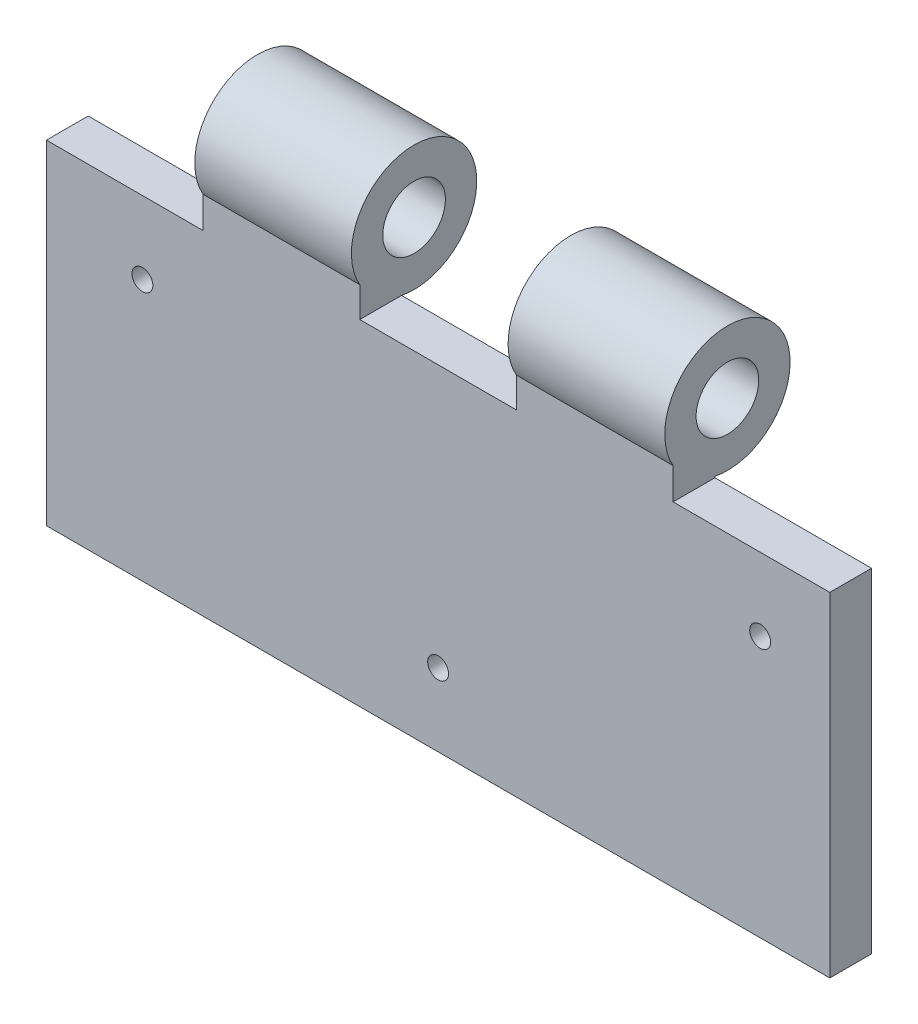
ISO-10303-21;
HEADER;
FILE_DESCRIPTION(('STEP AP214'),'2;1');
FILE_NAME('part.step','',(''),(''),'','','');
FILE_SCHEMA(('AUTOMOTIVE_DESIGN { 1 0 10303 214 1 1 1 1 }'));
ENDSEC;
DATA;
#1=APPLICATION_CONTEXT('core data for automotive mechanical design processes');
#2=APPLICATION_PROTOCOL_DEFINITION('international standard','automotive_design',2000,#1);
#3=PRODUCT_CONTEXT('',#1,'mechanical');
#4=PRODUCT('Part','Part','',(#3));
#5=PRODUCT_RELATED_PRODUCT_CATEGORY('part','',(#4));
#6=PRODUCT_DEFINITION_FORMATION('','',#4);
#7=PRODUCT_DEFINITION_CONTEXT('part definition',#1,'design');
#8=PRODUCT_DEFINITION('design','',#6,#7);
#9=PRODUCT_DEFINITION_SHAPE('','',#8);
#10=(LENGTH_UNIT() NAMED_UNIT(*) SI_UNIT(.MILLI.,.METRE.));
#11=(NAMED_UNIT(*) PLANE_ANGLE_UNIT() SI_UNIT($,.RADIAN.));
#12=(NAMED_UNIT(*) SI_UNIT($,.STERADIAN.) SOLID_ANGLE_UNIT());
#13=UNCERTAINTY_MEASURE_WITH_UNIT(LENGTH_MEASURE(1.E-05),#10,'distance_accuracy_value','');
#14=(GEOMETRIC_REPRESENTATION_CONTEXT(3) GLOBAL_UNCERTAINTY_ASSIGNED_CONTEXT((#13)) GLOBAL_UNIT_ASSIGNED_CONTEXT((#10,
#11,#12)) REPRESENTATION_CONTEXT('',''));
#15=CARTESIAN_POINT('',(0.,0.,0.));
#16=DIRECTION('',(0.,0.,1.));
#17=DIRECTION('',(1.,0.,0.));
#18=AXIS2_PLACEMENT_3D('',#15,#16,#17);
#19=CARTESIAN_POINT('',(0.,0.,4.));
#20=DIRECTION('',(0.,0.,1.));
#21=DIRECTION('',(1.,0.,0.));
#22=AXIS2_PLACEMENT_3D('',#19,#20,#21);
#23=PLANE('',#22);
#24=DIRECTION('',(0.,1.,0.));
#25=VECTOR('',#24,1.);
#26=CARTESIAN_POINT('',(15.,0.,4.));
#27=LINE('',#26,#25);
#28=CARTESIAN_POINT('',(15.,29.1962923306309,4.));
#29=VERTEX_POINT('',#28);
#30=CARTESIAN_POINT('',(15.,34.9678665123082,4.));
#31=VERTEX_POINT('',#30);
#32=EDGE_CURVE('E172',#29,#31,#27,.T.);
#33=ORIENTED_EDGE('',*,*,#32,.F.);
#34=DIRECTION('',(1.,0.,0.));
#35=VECTOR('',#34,1.);
#36=CARTESIAN_POINT('',(0.,29.1962923306309,4.));
#37=LINE('',#36,#35);
#38=CARTESIAN_POINT('',(-15.,29.1962923306309,4.));
#39=VERTEX_POINT('',#38);
#40=EDGE_CURVE('E145',#39,#29,#37,.T.);
#41=ORIENTED_EDGE('',*,*,#40,.F.);
#42=DIRECTION('',(0.,-1.,0.));
#43=VECTOR('',#42,1.);
#44=CARTESIAN_POINT('',(-15.,0.,4.));
#45=LINE('',#44,#43);
#46=CARTESIAN_POINT('',(-15.,34.9678665123082,4.));
#47=VERTEX_POINT('',#46);
#48=EDGE_CURVE('E564',#47,#39,#45,.T.);
#49=ORIENTED_EDGE('',*,*,#48,.F.);
#50=DIRECTION('',(1.,0.,0.));
#51=VECTOR('',#50,1.);
#52=CARTESIAN_POINT('',(-45.,34.9678665123082,4.));
#53=LINE('',#52,#51);
#54=CARTESIAN_POINT('',(-45.,34.9678665123082,4.));
#55=VERTEX_POINT('',#54);
#56=EDGE_CURVE('E528',#55,#47,#53,.T.);
#57=ORIENTED_EDGE('',*,*,#56,.F.);
#58=DIRECTION('',(0.,1.,0.));
#59=VECTOR('',#58,1.);
#60=CARTESIAN_POINT('',(-45.,0.,4.));
#61=LINE('',#60,#59);
#62=CARTESIAN_POINT('',(-45.,28.9537531894075,4.));
#63=VERTEX_POINT('',#62);
#64=EDGE_CURVE('E515',#63,#55,#61,.T.);
#65=ORIENTED_EDGE('',*,*,#64,.F.);
#66=DIRECTION('',(1.,0.,0.));
#67=VECTOR('',#66,1.);
#68=CARTESIAN_POINT('',(0.,28.9537531894075,4.));
#69=LINE('',#68,#67);
#70=CARTESIAN_POINT('',(-75.,28.9537531894075,4.));
#71=VERTEX_POINT('',#70);
#72=EDGE_CURVE('E508',#71,#63,#69,.T.);
#73=ORIENTED_EDGE('',*,*,#72,.F.);
#74=DIRECTION('',(0.,-1.,0.));
#75=VECTOR('',#74,1.);
#76=CARTESIAN_POINT('',(-75.,-35.,4.));
#77=LINE('',#76,#75);
#78=CARTESIAN_POINT('',(-75.,-35.,4.));
#79=VERTEX_POINT('',#78);
#80=EDGE_CURVE('E192',#71,#79,#77,.T.);
#81=ORIENTED_EDGE('',*,*,#80,.T.);
#82=DIRECTION('',(1.,0.,0.));
#83=VECTOR('',#82,1.);
#84=CARTESIAN_POINT('',(75.,-35.,4.));
#85=LINE('',#84,#83);
#86=CARTESIAN_POINT('',(75.,-35.,4.));
#87=VERTEX_POINT('',#86);
#88=EDGE_CURVE('E71',#79,#87,#85,.T.);
#89=ORIENTED_EDGE('',*,*,#88,.T.);
#90=DIRECTION('',(0.,1.,0.));
#91=VECTOR('',#90,1.);
#92=CARTESIAN_POINT('',(75.,-35.,4.));
#93=LINE('',#92,#91);
#94=CARTESIAN_POINT('',(75.,28.9537531894075,4.));
#95=VERTEX_POINT('',#94);
#96=EDGE_CURVE('E196',#87,#95,#93,.T.);
#97=ORIENTED_EDGE('',*,*,#96,.T.);
#98=DIRECTION('',(1.,0.,0.));
#99=VECTOR('',#98,1.);
#100=CARTESIAN_POINT('',(45.,28.9537531894075,4.));
#101=LINE('',#100,#99);
#102=CARTESIAN_POINT('',(45.,28.9537531894075,4.));
#103=VERTEX_POINT('',#102);
#104=EDGE_CURVE('E534',#103,#95,#101,.T.);
#105=ORIENTED_EDGE('',*,*,#104,.F.);
#106=DIRECTION('',(0.,-1.,0.));
#107=VECTOR('',#106,1.);
#108=CARTESIAN_POINT('',(45.,28.9537531894075,4.));
#109=LINE('',#108,#107);
#110=CARTESIAN_POINT('',(45.,34.9678665123082,4.));
#111=VERTEX_POINT('',#110);
#112=EDGE_CURVE('E514',#111,#103,#109,.T.);
#113=ORIENTED_EDGE('',*,*,#112,.F.);
#114=DIRECTION('',(1.,0.,0.));
#115=VECTOR('',#114,1.);
#116=CARTESIAN_POINT('',(15.,34.9678665123082,4.));
#117=LINE('',#116,#115);
#118=EDGE_CURVE('E174',#31,#111,#117,.T.);
#119=ORIENTED_EDGE('',*,*,#118,.F.);
#120=EDGE_LOOP('',(#33,#41,#49,#57,#65,#73,#81,#89,#97,#105,#113,#119));
#121=FACE_BOUND('',#120,.T.);
#122=CARTESIAN_POINT('',(-56.6305018989095,15.0158637322288,4.));
#123=DIRECTION('',(0.,0.,1.));
#124=DIRECTION('',(1.,0.,0.));
#125=AXIS2_PLACEMENT_3D('',#122,#123,#124);
#126=CIRCLE('',#125,2.);
#127=CARTESIAN_POINT('',(-54.6305018989095,15.0158637322288,4.));
#128=VERTEX_POINT('',#127);
#129=EDGE_CURVE('E184',#128,#128,#126,.T.);
#130=ORIENTED_EDGE('',*,*,#129,.F.);
#131=EDGE_LOOP('',(#130));
#132=FACE_BOUND('',#131,.T.);
#133=CARTESIAN_POINT('',(0.,-21.058085923715,4.));
#134=DIRECTION('',(0.,0.,1.));
#135=DIRECTION('',(1.,0.,0.));
#136=AXIS2_PLACEMENT_3D('',#133,#134,#135);
#137=CIRCLE('',#136,2.);
#138=CARTESIAN_POINT('',(2.,-21.058085923715,4.));
#139=VERTEX_POINT('',#138);
#140=EDGE_CURVE('E187',#139,#139,#137,.T.);
#141=ORIENTED_EDGE('',*,*,#140,.F.);
#142=EDGE_LOOP('',(#141));
#143=FACE_BOUND('',#142,.T.);
#144=CARTESIAN_POINT('',(61.6696567288971,15.0158637322288,4.));
#145=DIRECTION('',(0.,0.,1.));
#146=DIRECTION('',(1.,0.,0.));
#147=AXIS2_PLACEMENT_3D('',#144,#145,#146);
#148=CIRCLE('',#147,2.);
#149=CARTESIAN_POINT('',(63.6696567288971,15.0158637322288,4.));
#150=VERTEX_POINT('',#149);
#151=EDGE_CURVE('E176',#150,#150,#148,.T.);
#152=ORIENTED_EDGE('',*,*,#151,.F.);
#153=EDGE_LOOP('',(#152));
#154=FACE_BOUND('',#153,.T.);
#155=ADVANCED_FACE('F53',(#121,#132,#143,#154),#23,.T.);
#156=CARTESIAN_POINT('',(0.,0.,-4.));
#157=DIRECTION('',(0.,0.,1.));
#158=DIRECTION('',(1.,0.,0.));
#159=AXIS2_PLACEMENT_3D('',#156,#157,#158);
#160=PLANE('',#159);
#161=CARTESIAN_POINT('',(-56.6305018989095,15.0158637322288,-4.));
#162=DIRECTION('',(0.,0.,1.));
#163=DIRECTION('',(1.,0.,0.));
#164=AXIS2_PLACEMENT_3D('',#161,#162,#163);
#165=CIRCLE('',#164,5.99999999999998);
#166=CARTESIAN_POINT('',(-50.6305018989095,15.0158637322288,-4.));
#167=VERTEX_POINT('',#166);
#168=EDGE_CURVE('E215',#167,#167,#165,.T.);
#169=ORIENTED_EDGE('',*,*,#168,.T.);
#170=EDGE_LOOP('',(#169));
#171=FACE_BOUND('',#170,.T.);
#172=CARTESIAN_POINT('',(0.,-21.058085923715,-4.));
#173=DIRECTION('',(0.,0.,1.));
#174=DIRECTION('',(1.,0.,0.));
#175=AXIS2_PLACEMENT_3D('',#172,#173,#174);
#176=CIRCLE('',#175,5.99999999999998);
#177=CARTESIAN_POINT('',(5.99999999999998,-21.058085923715,-4.));
#178=VERTEX_POINT('',#177);
#179=EDGE_CURVE('E212',#178,#178,#176,.T.);
#180=ORIENTED_EDGE('',*,*,#179,.T.);
#181=EDGE_LOOP('',(#180));
#182=FACE_BOUND('',#181,.T.);
#183=CARTESIAN_POINT('',(61.6696567288971,15.0158637322288,-4.));
#184=DIRECTION('',(0.,0.,1.));
#185=DIRECTION('',(1.,0.,0.));
#186=AXIS2_PLACEMENT_3D('',#183,#184,#185);
#187=CIRCLE('',#186,5.99999999999994);
#188=CARTESIAN_POINT('',(67.6696567288971,15.0158637322288,-4.));
#189=VERTEX_POINT('',#188);
#190=EDGE_CURVE('E209',#189,#189,#187,.T.);
#191=ORIENTED_EDGE('',*,*,#190,.T.);
#192=EDGE_LOOP('',(#191));
#193=FACE_BOUND('',#192,.T.);
#194=DIRECTION('',(1.,0.,0.));
#195=VECTOR('',#194,1.);
#196=CARTESIAN_POINT('',(-45.,29.1962923306309,-4.));
#197=LINE('',#196,#195);
#198=CARTESIAN_POINT('',(-45.,29.1962923306309,-4.));
#199=VERTEX_POINT('',#198);
#200=CARTESIAN_POINT('',(-15.,29.1962923306309,-4.));
#201=VERTEX_POINT('',#200);
#202=EDGE_CURVE('E160',#199,#201,#197,.T.);
#203=ORIENTED_EDGE('',*,*,#202,.T.);
#204=DIRECTION('',(-1.,0.,0.));
#205=VECTOR('',#204,1.);
#206=CARTESIAN_POINT('',(15.,29.1962923306309,-4.));
#207=LINE('',#206,#205);
#208=CARTESIAN_POINT('',(15.,29.1962923306309,-4.));
#209=VERTEX_POINT('',#208);
#210=EDGE_CURVE('E90',#209,#201,#207,.T.);
#211=ORIENTED_EDGE('',*,*,#210,.F.);
#212=DIRECTION('',(1.,0.,0.));
#213=VECTOR('',#212,1.);
#214=CARTESIAN_POINT('',(15.,29.1962923306309,-4.));
#215=LINE('',#214,#213);
#216=CARTESIAN_POINT('',(45.,29.1962923306309,-4.));
#217=VERTEX_POINT('',#216);
#218=EDGE_CURVE('E158',#209,#217,#215,.T.);
#219=ORIENTED_EDGE('',*,*,#218,.T.);
#220=DIRECTION('',(0.,-1.,0.));
#221=VECTOR('',#220,1.);
#222=CARTESIAN_POINT('',(45.,0.,-4.));
#223=LINE('',#222,#221);
#224=CARTESIAN_POINT('',(45.,28.9537531894075,-4.));
#225=VERTEX_POINT('',#224);
#226=EDGE_CURVE('E540',#217,#225,#223,.T.);
#227=ORIENTED_EDGE('',*,*,#226,.T.);
#228=DIRECTION('',(1.,0.,0.));
#229=VECTOR('',#228,1.);
#230=CARTESIAN_POINT('',(0.,28.9537531894075,-4.));
#231=LINE('',#230,#229);
#232=CARTESIAN_POINT('',(75.,28.9537531894075,-4.));
#233=VERTEX_POINT('',#232);
#234=EDGE_CURVE('E543',#225,#233,#231,.T.);
#235=ORIENTED_EDGE('',*,*,#234,.T.);
#236=DIRECTION('',(0.,1.,0.));
#237=VECTOR('',#236,1.);
#238=CARTESIAN_POINT('',(75.,-35.,-4.));
#239=LINE('',#238,#237);
#240=CARTESIAN_POINT('',(75.,-35.,-4.));
#241=VERTEX_POINT('',#240);
#242=EDGE_CURVE('E194',#241,#233,#239,.T.);
#243=ORIENTED_EDGE('',*,*,#242,.F.);
#244=DIRECTION('',(1.,0.,0.));
#245=VECTOR('',#244,1.);
#246=CARTESIAN_POINT('',(75.,-35.,-4.));
#247=LINE('',#246,#245);
#248=CARTESIAN_POINT('',(-75.,-35.,-4.));
#249=VERTEX_POINT('',#248);
#250=EDGE_CURVE('E200',#249,#241,#247,.T.);
#251=ORIENTED_EDGE('',*,*,#250,.F.);
#252=DIRECTION('',(0.,-1.,0.));
#253=VECTOR('',#252,1.);
#254=CARTESIAN_POINT('',(-75.,-35.,-4.));
#255=LINE('',#254,#253);
#256=CARTESIAN_POINT('',(-75.,28.9537531894075,-4.));
#257=VERTEX_POINT('',#256);
#258=EDGE_CURVE('E81',#257,#249,#255,.T.);
#259=ORIENTED_EDGE('',*,*,#258,.F.);
#260=DIRECTION('',(-1.,0.,0.));
#261=VECTOR('',#260,1.);
#262=CARTESIAN_POINT('',(-75.,28.9537531894075,-4.));
#263=LINE('',#262,#261);
#264=CARTESIAN_POINT('',(-45.,28.9537531894075,-4.));
#265=VERTEX_POINT('',#264);
#266=EDGE_CURVE('E523',#265,#257,#263,.T.);
#267=ORIENTED_EDGE('',*,*,#266,.F.);
#268=DIRECTION('',(0.,-1.,0.));
#269=VECTOR('',#268,1.);
#270=CARTESIAN_POINT('',(-45.,35.,-4.));
#271=LINE('',#270,#269);
#272=EDGE_CURVE('E521',#199,#265,#271,.T.);
#273=ORIENTED_EDGE('',*,*,#272,.F.);
#274=EDGE_LOOP('',(#203,#211,#219,#227,#235,#243,#251,#259,#267,#273));
#275=FACE_BOUND('',#274,.T.);
#276=ADVANCED_FACE('F156',(#171,#182,#193,#275),#160,.F.);
#277=CARTESIAN_POINT('',(-75.,-35.,4.));
#278=DIRECTION('',(1.,0.,0.));
#279=DIRECTION('',(0.,0.,-1.));
#280=AXIS2_PLACEMENT_3D('',#277,#278,#279);
#281=PLANE('',#280);
#282=ORIENTED_EDGE('',*,*,#80,.F.);
#283=DIRECTION('',(0.,0.,-1.));
#284=VECTOR('',#283,1.);
#285=CARTESIAN_POINT('',(-75.,28.9537531894075,4.));
#286=LINE('',#285,#284);
#287=EDGE_CURVE('E12',#71,#257,#286,.T.);
#288=ORIENTED_EDGE('',*,*,#287,.T.);
#289=ORIENTED_EDGE('',*,*,#258,.T.);
#290=DIRECTION('',(0.,0.,-1.));
#291=VECTOR('',#290,1.);
#292=CARTESIAN_POINT('',(-75.,-35.,4.));
#293=LINE('',#292,#291);
#294=EDGE_CURVE('E168',#79,#249,#293,.T.);
#295=ORIENTED_EDGE('',*,*,#294,.F.);
#296=EDGE_LOOP('',(#282,#288,#289,#295));
#297=FACE_BOUND('',#296,.T.);
#298=ADVANCED_FACE('F236',(#297),#281,.F.);
#299=CARTESIAN_POINT('',(75.,-35.,4.));
#300=DIRECTION('',(0.,1.,0.));
#301=DIRECTION('',(-1.,0.,0.));
#302=AXIS2_PLACEMENT_3D('',#299,#300,#301);
#303=PLANE('',#302);
#304=ORIENTED_EDGE('',*,*,#250,.T.);
#305=DIRECTION('',(0.,0.,-1.));
#306=VECTOR('',#305,1.);
#307=CARTESIAN_POINT('',(75.,-35.,4.));
#308=LINE('',#307,#306);
#309=EDGE_CURVE('E198',#87,#241,#308,.T.);
#310=ORIENTED_EDGE('',*,*,#309,.F.);
#311=ORIENTED_EDGE('',*,*,#88,.F.);
#312=ORIENTED_EDGE('',*,*,#294,.T.);
#313=EDGE_LOOP('',(#304,#310,#311,#312));
#314=FACE_BOUND('',#313,.T.);
#315=ADVANCED_FACE('F243',(#314),#303,.F.);
#316=CARTESIAN_POINT('',(75.,-35.,4.));
#317=DIRECTION('',(-1.,0.,0.));
#318=DIRECTION('',(0.,0.,1.));
#319=AXIS2_PLACEMENT_3D('',#316,#317,#318);
#320=PLANE('',#319);
#321=ORIENTED_EDGE('',*,*,#242,.T.);
#322=DIRECTION('',(0.,0.,1.));
#323=VECTOR('',#322,1.);
#324=CARTESIAN_POINT('',(75.,28.9537531894075,-6.));
#325=LINE('',#324,#323);
#326=EDGE_CURVE('E537',#233,#95,#325,.T.);
#327=ORIENTED_EDGE('',*,*,#326,.T.);
#328=ORIENTED_EDGE('',*,*,#96,.F.);
#329=ORIENTED_EDGE('',*,*,#309,.T.);
#330=EDGE_LOOP('',(#321,#327,#328,#329));
#331=FACE_BOUND('',#330,.T.);
#332=ADVANCED_FACE('F249',(#331),#320,.F.);
#333=CARTESIAN_POINT('',(61.6696567288971,15.0158637322288,-26.));
#334=DIRECTION('',(0.,0.,1.));
#335=DIRECTION('',(1.,0.,0.));
#336=AXIS2_PLACEMENT_3D('',#333,#334,#335);
#337=CYLINDRICAL_SURFACE('',#336,2.);
#338=CARTESIAN_POINT('',(61.6696567288971,15.0158637322288,0.));
#339=DIRECTION('',(0.,0.,1.));
#340=DIRECTION('',(1.,0.,0.));
#341=AXIS2_PLACEMENT_3D('',#338,#339,#340);
#342=CIRCLE('',#341,2.);
#343=CARTESIAN_POINT('',(63.6696567288971,15.0158637322288,0.));
#344=VERTEX_POINT('',#343);
#345=EDGE_CURVE('E63',#344,#344,#342,.F.);
#346=ORIENTED_EDGE('',*,*,#345,.T.);
#347=EDGE_LOOP('',(#346));
#348=FACE_BOUND('',#347,.T.);
#349=ORIENTED_EDGE('',*,*,#151,.T.);
#350=EDGE_LOOP('',(#349));
#351=FACE_BOUND('',#350,.T.);
#352=ADVANCED_FACE('F226',(#348,#351),#337,.F.);
#353=CARTESIAN_POINT('',(0.,-21.058085923715,-26.));
#354=DIRECTION('',(0.,0.,1.));
#355=DIRECTION('',(1.,0.,0.));
#356=AXIS2_PLACEMENT_3D('',#353,#354,#355);
#357=CYLINDRICAL_SURFACE('',#356,2.);
#358=CARTESIAN_POINT('',(0.,-21.058085923715,0.));
#359=DIRECTION('',(0.,0.,1.));
#360=DIRECTION('',(1.,0.,0.));
#361=AXIS2_PLACEMENT_3D('',#358,#359,#360);
#362=CIRCLE('',#361,2.);
#363=CARTESIAN_POINT('',(2.,-21.058085923715,0.));
#364=VERTEX_POINT('',#363);
#365=EDGE_CURVE('E221',#364,#364,#362,.F.);
#366=ORIENTED_EDGE('',*,*,#365,.T.);
#367=EDGE_LOOP('',(#366));
#368=FACE_BOUND('',#367,.T.);
#369=ORIENTED_EDGE('',*,*,#140,.T.);
#370=EDGE_LOOP('',(#369));
#371=FACE_BOUND('',#370,.T.);
#372=ADVANCED_FACE('F274',(#368,#371),#357,.F.);
#373=CARTESIAN_POINT('',(-56.6305018989095,15.0158637322288,-26.));
#374=DIRECTION('',(0.,0.,1.));
#375=DIRECTION('',(1.,0.,0.));
#376=AXIS2_PLACEMENT_3D('',#373,#374,#375);
#377=CYLINDRICAL_SURFACE('',#376,2.);
#378=CARTESIAN_POINT('',(-56.6305018989095,15.0158637322288,0.));
#379=DIRECTION('',(0.,0.,1.));
#380=DIRECTION('',(1.,0.,0.));
#381=AXIS2_PLACEMENT_3D('',#378,#379,#380);
#382=CIRCLE('',#381,2.);
#383=CARTESIAN_POINT('',(-54.6305018989095,15.0158637322288,0.));
#384=VERTEX_POINT('',#383);
#385=EDGE_CURVE('E218',#384,#384,#382,.F.);
#386=ORIENTED_EDGE('',*,*,#385,.T.);
#387=EDGE_LOOP('',(#386));
#388=FACE_BOUND('',#387,.T.);
#389=ORIENTED_EDGE('',*,*,#129,.T.);
#390=EDGE_LOOP('',(#389));
#391=FACE_BOUND('',#390,.T.);
#392=ADVANCED_FACE('F277',(#388,#391),#377,.F.);
#393=CARTESIAN_POINT('',(15.,40.9537531894075,-6.40044040841181));
#394=DIRECTION('',(1.,0.,0.));
#395=DIRECTION('',(0.,0.,-1.));
#396=AXIS2_PLACEMENT_3D('',#393,#394,#395);
#397=CYLINDRICAL_SURFACE('',#396,12.);
#398=CARTESIAN_POINT('',(15.,40.9537531894075,-6.40044040841181));
#399=DIRECTION('',(1.,0.,0.));
#400=DIRECTION('',(0.,0.,-1.));
#401=AXIS2_PLACEMENT_3D('',#398,#399,#400);
#402=CIRCLE('',#401,12.);
#403=EDGE_CURVE('E166',#209,#31,#402,.T.);
#404=ORIENTED_EDGE('',*,*,#403,.T.);
#405=ORIENTED_EDGE('',*,*,#118,.T.);
#406=CARTESIAN_POINT('',(45.,40.9537531894075,-6.40044040841181));
#407=DIRECTION('',(1.,0.,0.));
#408=DIRECTION('',(0.,0.,-1.));
#409=AXIS2_PLACEMENT_3D('',#406,#407,#408);
#410=CIRCLE('',#409,12.);
#411=EDGE_CURVE('E167',#217,#111,#410,.T.);
#412=ORIENTED_EDGE('',*,*,#411,.F.);
#413=ORIENTED_EDGE('',*,*,#218,.F.);
#414=EDGE_LOOP('',(#404,#405,#412,#413));
#415=FACE_BOUND('',#414,.T.);
#416=ADVANCED_FACE('F164',(#415),#397,.T.);
#417=CARTESIAN_POINT('',(15.,40.9537531894075,-6.40044040841181));
#418=DIRECTION('',(1.,0.,0.));
#419=DIRECTION('',(0.,0.,-1.));
#420=AXIS2_PLACEMENT_3D('',#417,#418,#419);
#421=PLANE('',#420);
#422=ORIENTED_EDGE('',*,*,#32,.T.);
#423=ORIENTED_EDGE('',*,*,#403,.F.);
#424=DIRECTION('',(0.,0.,-1.));
#425=VECTOR('',#424,1.);
#426=CARTESIAN_POINT('',(15.,29.1962923306309,6.));
#427=LINE('',#426,#425);
#428=EDGE_CURVE('E142',#29,#209,#427,.T.);
#429=ORIENTED_EDGE('',*,*,#428,.F.);
#430=EDGE_LOOP('',(#422,#423,#429));
#431=FACE_BOUND('',#430,.T.);
#432=CARTESIAN_POINT('',(15.,40.9537531894075,-6.40044040841181));
#433=DIRECTION('',(1.,0.,0.));
#434=DIRECTION('',(0.,0.,-1.));
#435=AXIS2_PLACEMENT_3D('',#432,#433,#434);
#436=CIRCLE('',#435,6.);
#437=CARTESIAN_POINT('',(15.,40.9537531894075,-12.4004404084118));
#438=VERTEX_POINT('',#437);
#439=EDGE_CURVE('E178',#438,#438,#436,.T.);
#440=ORIENTED_EDGE('',*,*,#439,.T.);
#441=EDGE_LOOP('',(#440));
#442=FACE_BOUND('',#441,.T.);
#443=ADVANCED_FACE('F170',(#431,#442),#421,.F.);
#444=CARTESIAN_POINT('',(45.,40.9537531894075,-6.40044040841181));
#445=DIRECTION('',(1.,0.,0.));
#446=DIRECTION('',(0.,0.,-1.));
#447=AXIS2_PLACEMENT_3D('',#444,#445,#446);
#448=PLANE('',#447);
#449=ORIENTED_EDGE('',*,*,#226,.F.);
#450=ORIENTED_EDGE('',*,*,#411,.T.);
#451=ORIENTED_EDGE('',*,*,#112,.T.);
#452=DIRECTION('',(0.,0.,1.));
#453=VECTOR('',#452,1.);
#454=CARTESIAN_POINT('',(45.,28.9537531894075,-6.));
#455=LINE('',#454,#453);
#456=EDGE_CURVE('E536',#225,#103,#455,.T.);
#457=ORIENTED_EDGE('',*,*,#456,.F.);
#458=EDGE_LOOP('',(#449,#450,#451,#457));
#459=FACE_BOUND('',#458,.T.);
#460=CARTESIAN_POINT('',(45.,40.9537531894075,-6.40044040841181));
#461=DIRECTION('',(1.,0.,0.));
#462=DIRECTION('',(0.,0.,-1.));
#463=AXIS2_PLACEMENT_3D('',#460,#461,#462);
#464=CIRCLE('',#463,6.);
#465=CARTESIAN_POINT('',(45.,40.9537531894075,-12.4004404084118));
#466=VERTEX_POINT('',#465);
#467=EDGE_CURVE('E181',#466,#466,#464,.T.);
#468=ORIENTED_EDGE('',*,*,#467,.F.);
#469=EDGE_LOOP('',(#468));
#470=FACE_BOUND('',#469,.T.);
#471=ADVANCED_FACE('F292',(#459,#470),#448,.T.);
#472=CARTESIAN_POINT('',(15.,40.9537531894075,-6.40044040841181));
#473=DIRECTION('',(1.,0.,0.));
#474=DIRECTION('',(0.,0.,-1.));
#475=AXIS2_PLACEMENT_3D('',#472,#473,#474);
#476=CYLINDRICAL_SURFACE('',#475,6.);
#477=ORIENTED_EDGE('',*,*,#439,.F.);
#478=EDGE_LOOP('',(#477));
#479=FACE_BOUND('',#478,.T.);
#480=ORIENTED_EDGE('',*,*,#467,.T.);
#481=EDGE_LOOP('',(#480));
#482=FACE_BOUND('',#481,.T.);
#483=ADVANCED_FACE('F295',(#479,#482),#476,.F.);
#484=CARTESIAN_POINT('',(-45.,40.9537531894075,-6.40044040841181));
#485=DIRECTION('',(1.,0.,0.));
#486=DIRECTION('',(0.,0.,-1.));
#487=AXIS2_PLACEMENT_3D('',#484,#485,#486);
#488=CYLINDRICAL_SURFACE('',#487,12.);
#489=CARTESIAN_POINT('',(-45.,40.9537531894075,-6.40044040841181));
#490=DIRECTION('',(1.,0.,0.));
#491=DIRECTION('',(0.,0.,-1.));
#492=AXIS2_PLACEMENT_3D('',#489,#490,#491);
#493=CIRCLE('',#492,12.);
#494=EDGE_CURVE('E553',#199,#55,#493,.T.);
#495=ORIENTED_EDGE('',*,*,#494,.T.);
#496=ORIENTED_EDGE('',*,*,#56,.T.);
#497=CARTESIAN_POINT('',(-15.,40.9537531894075,-6.40044040841181));
#498=DIRECTION('',(1.,0.,0.));
#499=DIRECTION('',(0.,0.,-1.));
#500=AXIS2_PLACEMENT_3D('',#497,#498,#499);
#501=CIRCLE('',#500,12.);
#502=EDGE_CURVE('E550',#201,#47,#501,.T.);
#503=ORIENTED_EDGE('',*,*,#502,.F.);
#504=ORIENTED_EDGE('',*,*,#202,.F.);
#505=EDGE_LOOP('',(#495,#496,#503,#504));
#506=FACE_BOUND('',#505,.T.);
#507=ADVANCED_FACE('F301',(#506),#488,.T.);
#508=CARTESIAN_POINT('',(-45.,40.9537531894075,-6.40044040841181));
#509=DIRECTION('',(1.,0.,0.));
#510=DIRECTION('',(0.,0.,-1.));
#511=AXIS2_PLACEMENT_3D('',#508,#509,#510);
#512=PLANE('',#511);
#513=ORIENTED_EDGE('',*,*,#64,.T.);
#514=ORIENTED_EDGE('',*,*,#494,.F.);
#515=ORIENTED_EDGE('',*,*,#272,.T.);
#516=DIRECTION('',(0.,0.,-1.));
#517=VECTOR('',#516,1.);
#518=CARTESIAN_POINT('',(-45.,28.9537531894075,6.));
#519=LINE('',#518,#517);
#520=EDGE_CURVE('E510',#63,#265,#519,.T.);
#521=ORIENTED_EDGE('',*,*,#520,.F.);
#522=EDGE_LOOP('',(#513,#514,#515,#521));
#523=FACE_BOUND('',#522,.T.);
#524=CARTESIAN_POINT('',(-45.,40.9537531894075,-6.40044040841181));
#525=DIRECTION('',(1.,0.,0.));
#526=DIRECTION('',(0.,0.,-1.));
#527=AXIS2_PLACEMENT_3D('',#524,#525,#526);
#528=CIRCLE('',#527,6.);
#529=CARTESIAN_POINT('',(-45.,40.9537531894075,-12.4004404084118));
#530=VERTEX_POINT('',#529);
#531=EDGE_CURVE('E547',#530,#530,#528,.T.);
#532=ORIENTED_EDGE('',*,*,#531,.T.);
#533=EDGE_LOOP('',(#532));
#534=FACE_BOUND('',#533,.T.);
#535=ADVANCED_FACE('F305',(#523,#534),#512,.F.);
#536=CARTESIAN_POINT('',(-15.,40.9537531894075,-6.40044040841181));
#537=DIRECTION('',(1.,0.,0.));
#538=DIRECTION('',(0.,0.,-1.));
#539=AXIS2_PLACEMENT_3D('',#536,#537,#538);
#540=PLANE('',#539);
#541=ORIENTED_EDGE('',*,*,#502,.T.);
#542=ORIENTED_EDGE('',*,*,#48,.T.);
#543=DIRECTION('',(0.,0.,-1.));
#544=VECTOR('',#543,1.);
#545=CARTESIAN_POINT('',(-15.,29.1962923306309,6.));
#546=LINE('',#545,#544);
#547=EDGE_CURVE('E150',#39,#201,#546,.T.);
#548=ORIENTED_EDGE('',*,*,#547,.T.);
#549=EDGE_LOOP('',(#541,#542,#548));
#550=FACE_BOUND('',#549,.T.);
#551=CARTESIAN_POINT('',(-15.,40.9537531894075,-6.40044040841181));
#552=DIRECTION('',(1.,0.,0.));
#553=DIRECTION('',(0.,0.,-1.));
#554=AXIS2_PLACEMENT_3D('',#551,#552,#553);
#555=CIRCLE('',#554,6.);
#556=CARTESIAN_POINT('',(-15.,40.9537531894075,-12.4004404084118));
#557=VERTEX_POINT('',#556);
#558=EDGE_CURVE('E546',#557,#557,#555,.T.);
#559=ORIENTED_EDGE('',*,*,#558,.F.);
#560=EDGE_LOOP('',(#559));
#561=FACE_BOUND('',#560,.T.);
#562=ADVANCED_FACE('F307',(#550,#561),#540,.T.);
#563=CARTESIAN_POINT('',(-45.,40.9537531894075,-6.40044040841181));
#564=DIRECTION('',(1.,0.,0.));
#565=DIRECTION('',(0.,0.,-1.));
#566=AXIS2_PLACEMENT_3D('',#563,#564,#565);
#567=CYLINDRICAL_SURFACE('',#566,6.);
#568=ORIENTED_EDGE('',*,*,#531,.F.);
#569=EDGE_LOOP('',(#568));
#570=FACE_BOUND('',#569,.T.);
#571=ORIENTED_EDGE('',*,*,#558,.T.);
#572=EDGE_LOOP('',(#571));
#573=FACE_BOUND('',#572,.T.);
#574=ADVANCED_FACE('F262',(#570,#573),#567,.F.);
#575=CARTESIAN_POINT('',(-56.6305018989095,15.0158637322288,-4.));
#576=DIRECTION('',(0.,0.,-1.));
#577=DIRECTION('',(-1.,0.,0.));
#578=AXIS2_PLACEMENT_3D('',#575,#576,#577);
#579=CONICAL_SURFACE('',#578,5.99999999999998,0.785398163397446);
#580=ORIENTED_EDGE('',*,*,#385,.F.);
#581=EDGE_LOOP('',(#580));
#582=FACE_BOUND('',#581,.T.);
#583=ORIENTED_EDGE('',*,*,#168,.F.);
#584=EDGE_LOOP('',(#583));
#585=FACE_BOUND('',#584,.T.);
#586=ADVANCED_FACE('F257',(#582,#585),#579,.F.);
#587=CARTESIAN_POINT('',(0.,-21.058085923715,-4.));
#588=DIRECTION('',(0.,0.,-1.));
#589=DIRECTION('',(-1.,0.,0.));
#590=AXIS2_PLACEMENT_3D('',#587,#588,#589);
#591=CONICAL_SURFACE('',#590,5.99999999999998,0.785398163397446);
#592=ORIENTED_EDGE('',*,*,#365,.F.);
#593=EDGE_LOOP('',(#592));
#594=FACE_BOUND('',#593,.T.);
#595=ORIENTED_EDGE('',*,*,#179,.F.);
#596=EDGE_LOOP('',(#595));
#597=FACE_BOUND('',#596,.T.);
#598=ADVANCED_FACE('F232',(#594,#597),#591,.F.);
#599=CARTESIAN_POINT('',(61.6696567288971,15.0158637322288,-4.));
#600=DIRECTION('',(0.,0.,-1.));
#601=DIRECTION('',(-1.,0.,0.));
#602=AXIS2_PLACEMENT_3D('',#599,#600,#601);
#603=CONICAL_SURFACE('',#602,5.99999999999994,0.785398163397446);
#604=ORIENTED_EDGE('',*,*,#345,.F.);
#605=EDGE_LOOP('',(#604));
#606=FACE_BOUND('',#605,.T.);
#607=ORIENTED_EDGE('',*,*,#190,.F.);
#608=EDGE_LOOP('',(#607));
#609=FACE_BOUND('',#608,.T.);
#610=ADVANCED_FACE('F56',(#606,#609),#603,.F.);
#611=CARTESIAN_POINT('',(45.,28.9537531894075,-6.));
#612=DIRECTION('',(0.,-1.,0.));
#613=DIRECTION('',(0.,0.,-1.));
#614=AXIS2_PLACEMENT_3D('',#611,#612,#613);
#615=PLANE('',#614);
#616=ORIENTED_EDGE('',*,*,#456,.T.);
#617=ORIENTED_EDGE('',*,*,#104,.T.);
#618=ORIENTED_EDGE('',*,*,#326,.F.);
#619=ORIENTED_EDGE('',*,*,#234,.F.);
#620=EDGE_LOOP('',(#616,#617,#618,#619));
#621=FACE_BOUND('',#620,.T.);
#622=ADVANCED_FACE('F231',(#621),#615,.F.);
#623=CARTESIAN_POINT('',(-75.,28.9537531894075,6.));
#624=DIRECTION('',(0.,-1.,0.));
#625=DIRECTION('',(0.,0.,-1.));
#626=AXIS2_PLACEMENT_3D('',#623,#624,#625);
#627=PLANE('',#626);
#628=ORIENTED_EDGE('',*,*,#72,.T.);
#629=ORIENTED_EDGE('',*,*,#520,.T.);
#630=ORIENTED_EDGE('',*,*,#266,.T.);
#631=ORIENTED_EDGE('',*,*,#287,.F.);
#632=EDGE_LOOP('',(#628,#629,#630,#631));
#633=FACE_BOUND('',#632,.T.);
#634=ADVANCED_FACE('F319',(#633),#627,.F.);
#635=CARTESIAN_POINT('',(15.,29.1962923306309,6.));
#636=DIRECTION('',(0.,-1.,0.));
#637=DIRECTION('',(0.,0.,-1.));
#638=AXIS2_PLACEMENT_3D('',#635,#636,#637);
#639=PLANE('',#638);
#640=ORIENTED_EDGE('',*,*,#40,.T.);
#641=ORIENTED_EDGE('',*,*,#428,.T.);
#642=ORIENTED_EDGE('',*,*,#210,.T.);
#643=ORIENTED_EDGE('',*,*,#547,.F.);
#644=EDGE_LOOP('',(#640,#641,#642,#643));
#645=FACE_BOUND('',#644,.T.);
#646=ADVANCED_FACE('F143',(#645),#639,.F.);
#647=CLOSED_SHELL('',(#155,#276,#298,#315,#332,#352,#372,#392,#416,#443,#471,#483,#507,#535,
#562,#574,#586,#598,#610,#622,#634,#646));
#648=MANIFOLD_SOLID_BREP('B2',#647);
#649=ADVANCED_BREP_SHAPE_REPRESENTATION('',(#18,#648),#14);
#650=SHAPE_DEFINITION_REPRESENTATION(#9,#649);
ENDSEC;
END-ISO-10303-21;
